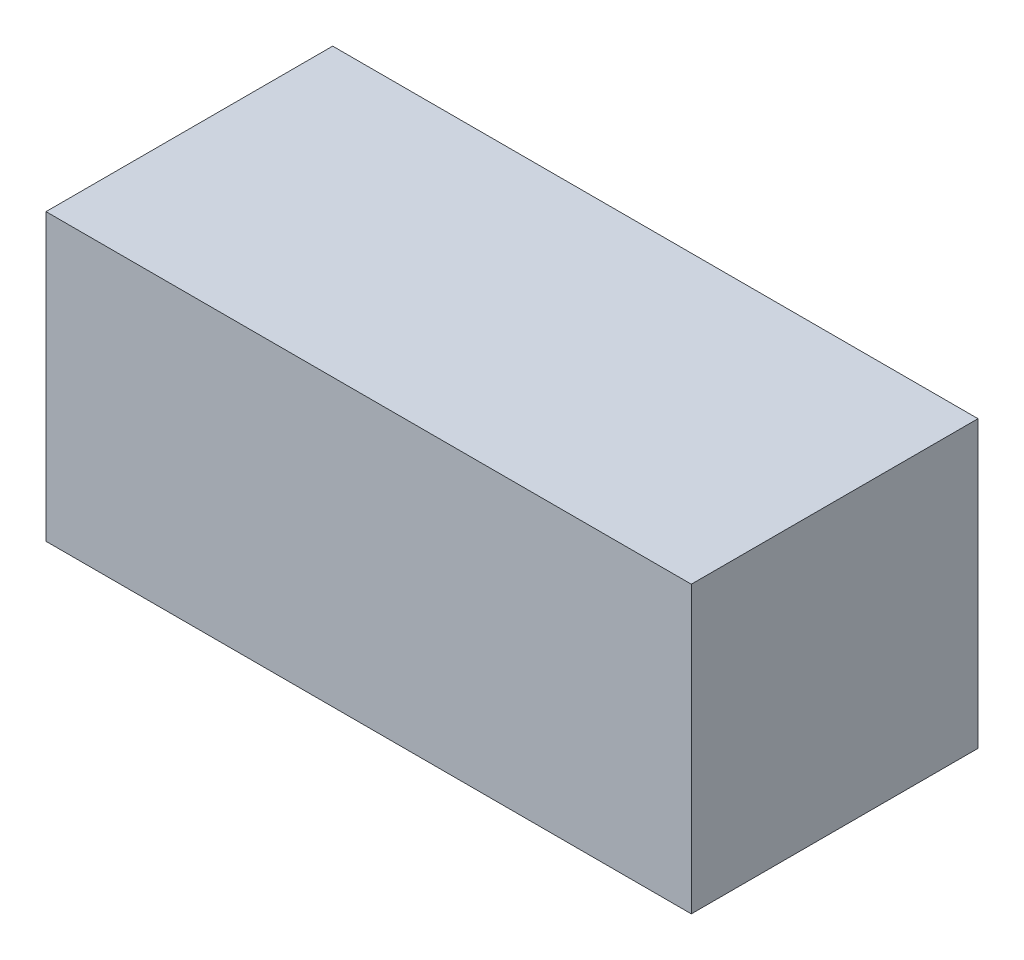
ISO-10303-21;
HEADER;
FILE_DESCRIPTION(('STEP AP214'),'2;1');
FILE_NAME('part.step','',(''),(''),'','','');
FILE_SCHEMA(('AUTOMOTIVE_DESIGN { 1 0 10303 214 1 1 1 1 }'));
ENDSEC;
DATA;
#1=APPLICATION_CONTEXT('core data for automotive mechanical design processes');
#2=APPLICATION_PROTOCOL_DEFINITION('international standard','automotive_design',2000,#1);
#3=PRODUCT_CONTEXT('',#1,'mechanical');
#4=PRODUCT('Part','Part','',(#3));
#5=PRODUCT_RELATED_PRODUCT_CATEGORY('part','',(#4));
#6=PRODUCT_DEFINITION_FORMATION('','',#4);
#7=PRODUCT_DEFINITION_CONTEXT('part definition',#1,'design');
#8=PRODUCT_DEFINITION('design','',#6,#7);
#9=PRODUCT_DEFINITION_SHAPE('','',#8);
#10=(LENGTH_UNIT() NAMED_UNIT(*) SI_UNIT(.MILLI.,.METRE.));
#11=(NAMED_UNIT(*) PLANE_ANGLE_UNIT() SI_UNIT($,.RADIAN.));
#12=(NAMED_UNIT(*) SI_UNIT($,.STERADIAN.) SOLID_ANGLE_UNIT());
#13=UNCERTAINTY_MEASURE_WITH_UNIT(LENGTH_MEASURE(1.E-05),#10,'distance_accuracy_value','');
#14=(GEOMETRIC_REPRESENTATION_CONTEXT(3) GLOBAL_UNCERTAINTY_ASSIGNED_CONTEXT((#13)) GLOBAL_UNIT_ASSIGNED_CONTEXT((#10,
#11,#12)) REPRESENTATION_CONTEXT('',''));
#15=CARTESIAN_POINT('',(0.,0.,0.));
#16=DIRECTION('',(0.,0.,1.));
#17=DIRECTION('',(1.,0.,0.));
#18=AXIS2_PLACEMENT_3D('',#15,#16,#17);
#19=CARTESIAN_POINT('',(-1.61255,-2.98755,0.));
#20=DIRECTION('',(1.,0.,0.));
#21=DIRECTION('',(0.,0.,1.));
#22=AXIS2_PLACEMENT_3D('',#19,#20,#21);
#23=PLANE('',#22);
#24=DIRECTION('',(0.,1.,0.));
#25=VECTOR('',#24,1.);
#26=CARTESIAN_POINT('',(-1.61255,-2.98755,0.1));
#27=LINE('',#26,#25);
#28=CARTESIAN_POINT('',(-1.61255,-2.98755,0.1));
#29=VERTEX_POINT('',#28);
#30=CARTESIAN_POINT('',(-1.61255,-2.88795,0.1));
#31=VERTEX_POINT('',#30);
#32=EDGE_CURVE('E11',#29,#31,#27,.T.);
#33=ORIENTED_EDGE('',*,*,#32,.T.);
#34=DIRECTION('',(0.,0.,1.));
#35=VECTOR('',#34,1.);
#36=CARTESIAN_POINT('',(-1.61255,-2.88795,0.));
#37=LINE('',#36,#35);
#38=CARTESIAN_POINT('',(-1.61255,-2.88795,0.));
#39=VERTEX_POINT('',#38);
#40=EDGE_CURVE('E24',#39,#31,#37,.T.);
#41=ORIENTED_EDGE('',*,*,#40,.F.);
#42=DIRECTION('',(0.,1.,0.));
#43=VECTOR('',#42,1.);
#44=CARTESIAN_POINT('',(-1.61255,-2.98755,0.));
#45=LINE('',#44,#43);
#46=CARTESIAN_POINT('',(-1.61255,-2.98755,0.));
#47=VERTEX_POINT('',#46);
#48=EDGE_CURVE('E86',#47,#39,#45,.T.);
#49=ORIENTED_EDGE('',*,*,#48,.F.);
#50=DIRECTION('',(0.,0.,1.));
#51=VECTOR('',#50,1.);
#52=CARTESIAN_POINT('',(-1.61255,-2.98755,0.));
#53=LINE('',#52,#51);
#54=EDGE_CURVE('E36',#47,#29,#53,.T.);
#55=ORIENTED_EDGE('',*,*,#54,.T.);
#56=EDGE_LOOP('',(#33,#41,#49,#55));
#57=FACE_BOUND('',#56,.T.);
#58=ADVANCED_FACE('F17',(#57),#23,.F.);
#59=CARTESIAN_POINT('',(-1.38745,-2.98755,0.));
#60=DIRECTION('',(1.,0.,0.));
#61=DIRECTION('',(0.,0.,1.));
#62=AXIS2_PLACEMENT_3D('',#59,#60,#61);
#63=PLANE('',#62);
#64=DIRECTION('',(0.,0.,1.));
#65=VECTOR('',#64,1.);
#66=CARTESIAN_POINT('',(-1.38745,-2.98755,0.));
#67=LINE('',#66,#65);
#68=CARTESIAN_POINT('',(-1.38745,-2.98755,0.));
#69=VERTEX_POINT('',#68);
#70=CARTESIAN_POINT('',(-1.38745,-2.98755,0.1));
#71=VERTEX_POINT('',#70);
#72=EDGE_CURVE('E83',#69,#71,#67,.T.);
#73=ORIENTED_EDGE('',*,*,#72,.F.);
#74=DIRECTION('',(0.,1.,0.));
#75=VECTOR('',#74,1.);
#76=CARTESIAN_POINT('',(-1.38745,-2.98755,0.));
#77=LINE('',#76,#75);
#78=CARTESIAN_POINT('',(-1.38745,-2.88795,0.));
#79=VERTEX_POINT('',#78);
#80=EDGE_CURVE('E63',#69,#79,#77,.T.);
#81=ORIENTED_EDGE('',*,*,#80,.T.);
#82=DIRECTION('',(0.,0.,1.));
#83=VECTOR('',#82,1.);
#84=CARTESIAN_POINT('',(-1.38745,-2.88795,0.));
#85=LINE('',#84,#83);
#86=CARTESIAN_POINT('',(-1.38745,-2.88795,0.1));
#87=VERTEX_POINT('',#86);
#88=EDGE_CURVE('E57',#79,#87,#85,.T.);
#89=ORIENTED_EDGE('',*,*,#88,.T.);
#90=DIRECTION('',(0.,1.,0.));
#91=VECTOR('',#90,1.);
#92=CARTESIAN_POINT('',(-1.38745,-2.98755,0.1));
#93=LINE('',#92,#91);
#94=EDGE_CURVE('E60',#71,#87,#93,.T.);
#95=ORIENTED_EDGE('',*,*,#94,.F.);
#96=EDGE_LOOP('',(#73,#81,#89,#95));
#97=FACE_BOUND('',#96,.T.);
#98=ADVANCED_FACE('F59',(#97),#63,.T.);
#99=CARTESIAN_POINT('',(-1.61255,-2.98755,0.));
#100=DIRECTION('',(0.,1.,0.));
#101=DIRECTION('',(0.,0.,1.));
#102=AXIS2_PLACEMENT_3D('',#99,#100,#101);
#103=PLANE('',#102);
#104=ORIENTED_EDGE('',*,*,#72,.T.);
#105=DIRECTION('',(1.,0.,0.));
#106=VECTOR('',#105,1.);
#107=CARTESIAN_POINT('',(-1.61255,-2.98755,0.1));
#108=LINE('',#107,#106);
#109=EDGE_CURVE('E71',#29,#71,#108,.T.);
#110=ORIENTED_EDGE('',*,*,#109,.F.);
#111=ORIENTED_EDGE('',*,*,#54,.F.);
#112=DIRECTION('',(1.,0.,0.));
#113=VECTOR('',#112,1.);
#114=CARTESIAN_POINT('',(-1.61255,-2.98755,0.));
#115=LINE('',#114,#113);
#116=EDGE_CURVE('E76',#47,#69,#115,.T.);
#117=ORIENTED_EDGE('',*,*,#116,.T.);
#118=EDGE_LOOP('',(#104,#110,#111,#117));
#119=FACE_BOUND('',#118,.T.);
#120=ADVANCED_FACE('F91',(#119),#103,.F.);
#121=CARTESIAN_POINT('',(-1.61255,-2.88795,0.));
#122=DIRECTION('',(0.,1.,0.));
#123=DIRECTION('',(0.,0.,1.));
#124=AXIS2_PLACEMENT_3D('',#121,#122,#123);
#125=PLANE('',#124);
#126=DIRECTION('',(1.,0.,0.));
#127=VECTOR('',#126,1.);
#128=CARTESIAN_POINT('',(-1.61255,-2.88795,0.));
#129=LINE('',#128,#127);
#130=EDGE_CURVE('E74',#39,#79,#129,.T.);
#131=ORIENTED_EDGE('',*,*,#130,.F.);
#132=ORIENTED_EDGE('',*,*,#40,.T.);
#133=DIRECTION('',(1.,0.,0.));
#134=VECTOR('',#133,1.);
#135=CARTESIAN_POINT('',(-1.61255,-2.88795,0.1));
#136=LINE('',#135,#134);
#137=EDGE_CURVE('E69',#31,#87,#136,.T.);
#138=ORIENTED_EDGE('',*,*,#137,.T.);
#139=ORIENTED_EDGE('',*,*,#88,.F.);
#140=EDGE_LOOP('',(#131,#132,#138,#139));
#141=FACE_BOUND('',#140,.T.);
#142=ADVANCED_FACE('F73',(#141),#125,.T.);
#143=CARTESIAN_POINT('',(-1.61255,-2.98755,0.));
#144=DIRECTION('',(0.,0.,1.));
#145=DIRECTION('',(1.,0.,0.));
#146=AXIS2_PLACEMENT_3D('',#143,#144,#145);
#147=PLANE('',#146);
#148=ORIENTED_EDGE('',*,*,#130,.T.);
#149=ORIENTED_EDGE('',*,*,#80,.F.);
#150=ORIENTED_EDGE('',*,*,#116,.F.);
#151=ORIENTED_EDGE('',*,*,#48,.T.);
#152=EDGE_LOOP('',(#148,#149,#150,#151));
#153=FACE_BOUND('',#152,.T.);
#154=ADVANCED_FACE('F89',(#153),#147,.F.);
#155=CARTESIAN_POINT('',(-1.61255,-2.98755,0.1));
#156=DIRECTION('',(0.,0.,1.));
#157=DIRECTION('',(1.,0.,0.));
#158=AXIS2_PLACEMENT_3D('',#155,#156,#157);
#159=PLANE('',#158);
#160=ORIENTED_EDGE('',*,*,#32,.F.);
#161=ORIENTED_EDGE('',*,*,#109,.T.);
#162=ORIENTED_EDGE('',*,*,#94,.T.);
#163=ORIENTED_EDGE('',*,*,#137,.F.);
#164=EDGE_LOOP('',(#160,#161,#162,#163));
#165=FACE_BOUND('',#164,.T.);
#166=ADVANCED_FACE('F68',(#165),#159,.T.);
#167=CLOSED_SHELL('',(#58,#98,#120,#142,#154,#166));
#168=MANIFOLD_SOLID_BREP('B1',#167);
#169=ADVANCED_BREP_SHAPE_REPRESENTATION('',(#18,#168),#14);
#170=SHAPE_DEFINITION_REPRESENTATION(#9,#169);
ENDSEC;
END-ISO-10303-21;
